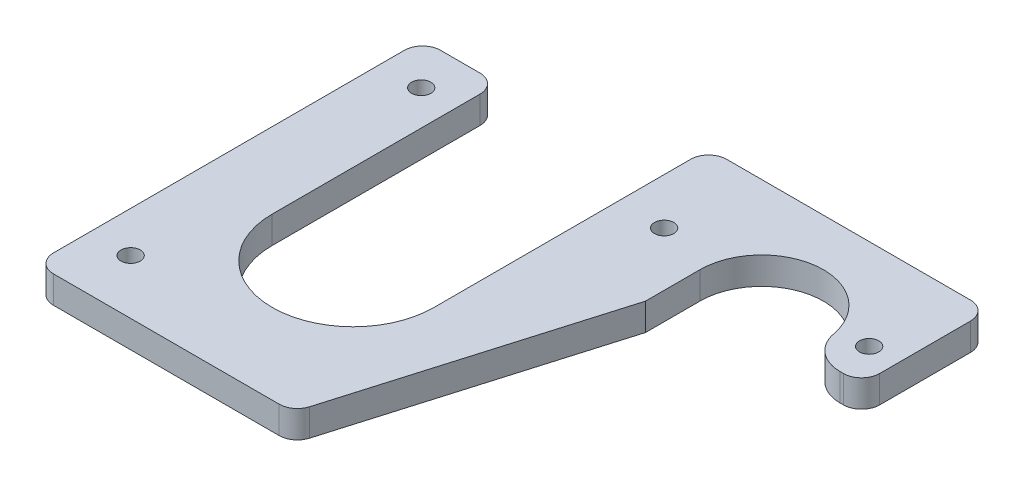
ISO-10303-21;
HEADER;
FILE_DESCRIPTION(('STEP AP214'),'2;1');
FILE_NAME('part.step','',(''),(''),'','','');
FILE_SCHEMA(('AUTOMOTIVE_DESIGN { 1 0 10303 214 1 1 1 1 }'));
ENDSEC;
DATA;
#1=APPLICATION_CONTEXT('core data for automotive mechanical design processes');
#2=APPLICATION_PROTOCOL_DEFINITION('international standard','automotive_design',2000,#1);
#3=PRODUCT_CONTEXT('',#1,'mechanical');
#4=PRODUCT('Part','Part','',(#3));
#5=PRODUCT_RELATED_PRODUCT_CATEGORY('part','',(#4));
#6=PRODUCT_DEFINITION_FORMATION('','',#4);
#7=PRODUCT_DEFINITION_CONTEXT('part definition',#1,'design');
#8=PRODUCT_DEFINITION('design','',#6,#7);
#9=PRODUCT_DEFINITION_SHAPE('','',#8);
#10=(LENGTH_UNIT() NAMED_UNIT(*) SI_UNIT(.MILLI.,.METRE.));
#11=(NAMED_UNIT(*) PLANE_ANGLE_UNIT() SI_UNIT($,.RADIAN.));
#12=(NAMED_UNIT(*) SI_UNIT($,.STERADIAN.) SOLID_ANGLE_UNIT());
#13=UNCERTAINTY_MEASURE_WITH_UNIT(LENGTH_MEASURE(1.E-05),#10,'distance_accuracy_value','');
#14=(GEOMETRIC_REPRESENTATION_CONTEXT(3) GLOBAL_UNCERTAINTY_ASSIGNED_CONTEXT((#13)) GLOBAL_UNIT_ASSIGNED_CONTEXT((#10,
#11,#12)) REPRESENTATION_CONTEXT('',''));
#15=CARTESIAN_POINT('',(0.,0.,0.));
#16=DIRECTION('',(0.,0.,1.));
#17=DIRECTION('',(1.,0.,0.));
#18=AXIS2_PLACEMENT_3D('',#15,#16,#17);
#19=CARTESIAN_POINT('',(82.55,9.525,0.));
#20=DIRECTION('',(-0.959204567325331,0.,-0.282712925106413));
#21=DIRECTION('',(-0.282712925106413,0.,0.959204567325331));
#22=AXIS2_PLACEMENT_3D('',#19,#20,#21);
#23=PLANE('',#22);
#24=DIRECTION('',(0.282712925106413,0.,-0.959204567325331));
#25=VECTOR('',#24,1.);
#26=CARTESIAN_POINT('',(82.55,9.525,0.));
#27=LINE('',#26,#25);
#28=CARTESIAN_POINT('',(91.378775178064,9.525,-29.9547729255743));
#29=VERTEX_POINT('',#28);
#30=CARTESIAN_POINT('',(118.11,9.525,-120.65));
#31=VERTEX_POINT('',#30);
#32=EDGE_CURVE('E232',#29,#31,#27,.T.);
#33=ORIENTED_EDGE('',*,*,#32,.F.);
#34=DIRECTION('',(0.,-1.,0.));
#35=VECTOR('',#34,1.);
#36=CARTESIAN_POINT('',(91.378775178064,9.525,-29.9547729255743));
#37=LINE('',#36,#35);
#38=CARTESIAN_POINT('',(91.378775178064,0.,-29.9547729255743));
#39=VERTEX_POINT('',#38);
#40=EDGE_CURVE('E299',#29,#39,#37,.T.);
#41=ORIENTED_EDGE('',*,*,#40,.T.);
#42=DIRECTION('',(0.282712925106413,0.,-0.959204567325331));
#43=VECTOR('',#42,1.);
#44=CARTESIAN_POINT('',(82.55,0.,0.));
#45=LINE('',#44,#43);
#46=CARTESIAN_POINT('',(118.11,0.,-120.65));
#47=VERTEX_POINT('',#46);
#48=EDGE_CURVE('E231',#39,#47,#45,.T.);
#49=ORIENTED_EDGE('',*,*,#48,.T.);
#50=DIRECTION('',(0.,-1.,0.));
#51=VECTOR('',#50,1.);
#52=CARTESIAN_POINT('',(118.11,9.525,-120.65));
#53=LINE('',#52,#51);
#54=EDGE_CURVE('E265',#31,#47,#53,.T.);
#55=ORIENTED_EDGE('',*,*,#54,.F.);
#56=EDGE_LOOP('',(#33,#41,#49,#55));
#57=FACE_BOUND('',#56,.T.);
#58=ADVANCED_FACE('F32',(#57),#23,.F.);
#59=CARTESIAN_POINT('',(118.11,9.525,-139.7));
#60=DIRECTION('',(-1.,0.,0.));
#61=DIRECTION('',(0.,0.,1.));
#62=AXIS2_PLACEMENT_3D('',#59,#60,#61);
#63=PLANE('',#62);
#64=DIRECTION('',(0.,0.,-1.));
#65=VECTOR('',#64,1.);
#66=CARTESIAN_POINT('',(118.11,0.,-139.7));
#67=LINE('',#66,#65);
#68=CARTESIAN_POINT('',(118.11,0.,-139.7));
#69=VERTEX_POINT('',#68);
#70=EDGE_CURVE('E250',#47,#69,#67,.T.);
#71=ORIENTED_EDGE('',*,*,#70,.T.);
#72=DIRECTION('',(0.,-1.,0.));
#73=VECTOR('',#72,1.);
#74=CARTESIAN_POINT('',(118.11,9.525,-139.7));
#75=LINE('',#74,#73);
#76=CARTESIAN_POINT('',(118.11,9.525,-139.7));
#77=VERTEX_POINT('',#76);
#78=EDGE_CURVE('E248',#77,#69,#75,.T.);
#79=ORIENTED_EDGE('',*,*,#78,.F.);
#80=DIRECTION('',(0.,0.,-1.));
#81=VECTOR('',#80,1.);
#82=CARTESIAN_POINT('',(118.11,9.525,-139.7));
#83=LINE('',#82,#81);
#84=EDGE_CURVE('E234',#31,#77,#83,.T.);
#85=ORIENTED_EDGE('',*,*,#84,.F.);
#86=ORIENTED_EDGE('',*,*,#54,.T.);
#87=EDGE_LOOP('',(#71,#79,#85,#86));
#88=FACE_BOUND('',#87,.T.);
#89=ADVANCED_FACE('F365',(#88),#63,.F.);
#90=CARTESIAN_POINT('',(139.7,9.525,-139.7));
#91=DIRECTION('',(0.,-1.,0.));
#92=DIRECTION('',(0.,0.,-1.));
#93=AXIS2_PLACEMENT_3D('',#90,#91,#92);
#94=CYLINDRICAL_SURFACE('',#93,21.59);
#95=CARTESIAN_POINT('',(139.7,0.,-139.7));
#96=DIRECTION('',(0.,-1.,0.));
#97=DIRECTION('',(0.,0.,1.));
#98=AXIS2_PLACEMENT_3D('',#95,#96,#97);
#99=CIRCLE('',#98,21.59);
#100=CARTESIAN_POINT('',(160.916571621859,0.,-143.698148148148));
#101=VERTEX_POINT('',#100);
#102=EDGE_CURVE('E252',#69,#101,#99,.T.);
#103=ORIENTED_EDGE('',*,*,#102,.T.);
#104=DIRECTION('',(0.,-1.,0.));
#105=VECTOR('',#104,1.);
#106=CARTESIAN_POINT('',(160.916571621859,9.525,-143.698148148148));
#107=LINE('',#106,#105);
#108=CARTESIAN_POINT('',(160.916571621859,9.525,-143.698148148148));
#109=VERTEX_POINT('',#108);
#110=EDGE_CURVE('E323',#101,#109,#107,.F.);
#111=ORIENTED_EDGE('',*,*,#110,.T.);
#112=CARTESIAN_POINT('',(139.7,9.525,-139.7));
#113=DIRECTION('',(0.,-1.,0.));
#114=DIRECTION('',(0.,0.,1.));
#115=AXIS2_PLACEMENT_3D('',#112,#113,#114);
#116=CIRCLE('',#115,21.59);
#117=EDGE_CURVE('E237',#77,#109,#116,.T.);
#118=ORIENTED_EDGE('',*,*,#117,.F.);
#119=ORIENTED_EDGE('',*,*,#78,.T.);
#120=EDGE_LOOP('',(#103,#111,#118,#119));
#121=FACE_BOUND('',#120,.T.);
#122=ADVANCED_FACE('F371',(#121),#94,.F.);
#123=CARTESIAN_POINT('',(180.975,9.525,-139.7));
#124=DIRECTION('',(-1.,0.,0.));
#125=DIRECTION('',(0.,0.,1.));
#126=AXIS2_PLACEMENT_3D('',#123,#124,#125);
#127=PLANE('',#126);
#128=DIRECTION('',(0.,0.,-1.));
#129=VECTOR('',#128,1.);
#130=CARTESIAN_POINT('',(180.975,9.525,-139.7));
#131=LINE('',#130,#129);
#132=CARTESIAN_POINT('',(180.975,9.525,-139.7));
#133=VERTEX_POINT('',#132);
#134=CARTESIAN_POINT('',(180.975,9.525,-171.45));
#135=VERTEX_POINT('',#134);
#136=EDGE_CURVE('E240',#133,#135,#131,.T.);
#137=ORIENTED_EDGE('',*,*,#136,.F.);
#138=DIRECTION('',(0.,1.,0.));
#139=VECTOR('',#138,1.);
#140=CARTESIAN_POINT('',(180.975,9.525,-139.7));
#141=LINE('',#140,#139);
#142=CARTESIAN_POINT('',(180.975,0.,-139.7));
#143=VERTEX_POINT('',#142);
#144=EDGE_CURVE('E318',#133,#143,#141,.F.);
#145=ORIENTED_EDGE('',*,*,#144,.T.);
#146=DIRECTION('',(0.,0.,-1.));
#147=VECTOR('',#146,1.);
#148=CARTESIAN_POINT('',(180.975,0.,-139.7));
#149=LINE('',#148,#147);
#150=CARTESIAN_POINT('',(180.975,0.,-171.45));
#151=VERTEX_POINT('',#150);
#152=EDGE_CURVE('E255',#143,#151,#149,.T.);
#153=ORIENTED_EDGE('',*,*,#152,.T.);
#154=DIRECTION('',(0.,-1.,0.));
#155=VECTOR('',#154,1.);
#156=CARTESIAN_POINT('',(180.975,9.525,-171.45));
#157=LINE('',#156,#155);
#158=EDGE_CURVE('E282',#151,#135,#157,.F.);
#159=ORIENTED_EDGE('',*,*,#158,.T.);
#160=EDGE_LOOP('',(#137,#145,#153,#159));
#161=FACE_BOUND('',#160,.T.);
#162=ADVANCED_FACE('F479',(#161),#127,.F.);
#163=CARTESIAN_POINT('',(80.9625,9.525,-177.8));
#164=DIRECTION('',(0.,0.,1.));
#165=DIRECTION('',(1.,0.,0.));
#166=AXIS2_PLACEMENT_3D('',#163,#164,#165);
#167=PLANE('',#166);
#168=DIRECTION('',(-1.,0.,0.));
#169=VECTOR('',#168,1.);
#170=CARTESIAN_POINT('',(80.9625,0.,-177.8));
#171=LINE('',#170,#169);
#172=CARTESIAN_POINT('',(174.625,0.,-177.8));
#173=VERTEX_POINT('',#172);
#174=CARTESIAN_POINT('',(89.4013784008273,0.,-177.8));
#175=VERTEX_POINT('',#174);
#176=EDGE_CURVE('E257',#173,#175,#171,.T.);
#177=ORIENTED_EDGE('',*,*,#176,.T.);
#178=DIRECTION('',(0.,1.,0.));
#179=VECTOR('',#178,1.);
#180=CARTESIAN_POINT('',(89.4013784008273,9.525,-177.8));
#181=LINE('',#180,#179);
#182=CARTESIAN_POINT('',(89.4013784008273,9.525,-177.8));
#183=VERTEX_POINT('',#182);
#184=EDGE_CURVE('E40',#175,#183,#181,.T.);
#185=ORIENTED_EDGE('',*,*,#184,.T.);
#186=DIRECTION('',(-1.,0.,0.));
#187=VECTOR('',#186,1.);
#188=CARTESIAN_POINT('',(180.975,9.525,-177.8));
#189=LINE('',#188,#187);
#190=CARTESIAN_POINT('',(174.625,9.525,-177.8));
#191=VERTEX_POINT('',#190);
#192=EDGE_CURVE('E242',#191,#183,#189,.T.);
#193=ORIENTED_EDGE('',*,*,#192,.F.);
#194=DIRECTION('',(0.,-1.,0.));
#195=VECTOR('',#194,1.);
#196=CARTESIAN_POINT('',(174.625,9.525,-177.8));
#197=LINE('',#196,#195);
#198=EDGE_CURVE('E304',#191,#173,#197,.T.);
#199=ORIENTED_EDGE('',*,*,#198,.T.);
#200=EDGE_LOOP('',(#177,#185,#193,#199));
#201=FACE_BOUND('',#200,.T.);
#202=ADVANCED_FACE('F345',(#201),#167,.F.);
#203=CARTESIAN_POINT('',(0.,9.525,-160.782));
#204=DIRECTION('',(0.,0.,1.));
#205=DIRECTION('',(1.,0.,0.));
#206=AXIS2_PLACEMENT_3D('',#203,#204,#205);
#207=PLANE('',#206);
#208=DIRECTION('',(-1.,0.,0.));
#209=VECTOR('',#208,1.);
#210=CARTESIAN_POINT('',(0.,9.525,-160.782));
#211=LINE('',#210,#209);
#212=CARTESIAN_POINT('',(20.1361215991727,9.525,-160.782));
#213=VERTEX_POINT('',#212);
#214=CARTESIAN_POINT('',(6.35,9.525,-160.782));
#215=VERTEX_POINT('',#214);
#216=EDGE_CURVE('E244',#213,#215,#211,.T.);
#217=ORIENTED_EDGE('',*,*,#216,.F.);
#218=DIRECTION('',(0.,-1.,0.));
#219=VECTOR('',#218,1.);
#220=CARTESIAN_POINT('',(20.1361215991727,9.525,-160.782));
#221=LINE('',#220,#219);
#222=CARTESIAN_POINT('',(20.1361215991727,0.,-160.782));
#223=VERTEX_POINT('',#222);
#224=EDGE_CURVE('E332',#213,#223,#221,.T.);
#225=ORIENTED_EDGE('',*,*,#224,.T.);
#226=DIRECTION('',(-1.,0.,0.));
#227=VECTOR('',#226,1.);
#228=CARTESIAN_POINT('',(0.,0.,-160.782));
#229=LINE('',#228,#227);
#230=CARTESIAN_POINT('',(6.35,0.,-160.782));
#231=VERTEX_POINT('',#230);
#232=EDGE_CURVE('E260',#223,#231,#229,.T.);
#233=ORIENTED_EDGE('',*,*,#232,.T.);
#234=DIRECTION('',(0.,-1.,0.));
#235=VECTOR('',#234,1.);
#236=CARTESIAN_POINT('',(6.35,9.525,-160.782));
#237=LINE('',#236,#235);
#238=EDGE_CURVE('E310',#231,#215,#237,.F.);
#239=ORIENTED_EDGE('',*,*,#238,.T.);
#240=EDGE_LOOP('',(#217,#225,#233,#239));
#241=FACE_BOUND('',#240,.T.);
#242=ADVANCED_FACE('F436',(#241),#207,.F.);
#243=CARTESIAN_POINT('',(0.,9.525,-160.782));
#244=DIRECTION('',(1.,0.,0.));
#245=DIRECTION('',(0.,0.,-1.));
#246=AXIS2_PLACEMENT_3D('',#243,#244,#245);
#247=PLANE('',#246);
#248=DIRECTION('',(0.,0.,1.));
#249=VECTOR('',#248,1.);
#250=CARTESIAN_POINT('',(0.,9.525,-160.782));
#251=LINE('',#250,#249);
#252=CARTESIAN_POINT('',(0.,9.525,-154.432));
#253=VERTEX_POINT('',#252);
#254=CARTESIAN_POINT('',(0.,9.525,-31.75));
#255=VERTEX_POINT('',#254);
#256=EDGE_CURVE('E246',#253,#255,#251,.T.);
#257=ORIENTED_EDGE('',*,*,#256,.F.);
#258=DIRECTION('',(0.,-1.,0.));
#259=VECTOR('',#258,1.);
#260=CARTESIAN_POINT('',(0.,9.525,-154.432));
#261=LINE('',#260,#259);
#262=CARTESIAN_POINT('',(0.,0.,-154.432));
#263=VERTEX_POINT('',#262);
#264=EDGE_CURVE('E307',#253,#263,#261,.T.);
#265=ORIENTED_EDGE('',*,*,#264,.T.);
#266=DIRECTION('',(0.,0.,1.));
#267=VECTOR('',#266,1.);
#268=CARTESIAN_POINT('',(0.,0.,-160.782));
#269=LINE('',#268,#267);
#270=CARTESIAN_POINT('',(0.,0.,-31.75));
#271=VERTEX_POINT('',#270);
#272=EDGE_CURVE('E235',#263,#271,#269,.T.);
#273=ORIENTED_EDGE('',*,*,#272,.T.);
#274=DIRECTION('',(0.,1.,0.));
#275=VECTOR('',#274,1.);
#276=CARTESIAN_POINT('',(0.,9.525,-31.75));
#277=LINE('',#276,#275);
#278=EDGE_CURVE('E270',#271,#255,#277,.T.);
#279=ORIENTED_EDGE('',*,*,#278,.T.);
#280=EDGE_LOOP('',(#257,#265,#273,#279));
#281=FACE_BOUND('',#280,.T.);
#282=ADVANCED_FACE('F431',(#281),#247,.F.);
#283=CARTESIAN_POINT('',(139.7,9.525,-139.7));
#284=DIRECTION('',(0.,1.,0.));
#285=DIRECTION('',(0.,0.,1.));
#286=AXIS2_PLACEMENT_3D('',#283,#284,#285);
#287=PLANE('',#286);
#288=DIRECTION('',(0.,0.,1.));
#289=VECTOR('',#288,1.);
#290=CARTESIAN_POINT('',(26.4861215991727,9.525,-81.75625));
#291=LINE('',#290,#289);
#292=CARTESIAN_POINT('',(26.4861215991727,9.525,-154.432));
#293=VERTEX_POINT('',#292);
#294=CARTESIAN_POINT('',(26.4861215991727,9.525,-81.75625));
#295=VERTEX_POINT('',#294);
#296=EDGE_CURVE('E191',#293,#295,#291,.T.);
#297=ORIENTED_EDGE('',*,*,#296,.F.);
#298=CARTESIAN_POINT('',(20.1361215991727,9.525,-154.432));
#299=DIRECTION('',(0.,1.,0.));
#300=DIRECTION('',(0.,0.,1.));
#301=AXIS2_PLACEMENT_3D('',#298,#299,#300);
#302=CIRCLE('',#301,6.35);
#303=EDGE_CURVE('E342',#293,#213,#302,.T.);
#304=ORIENTED_EDGE('',*,*,#303,.T.);
#305=ORIENTED_EDGE('',*,*,#216,.T.);
#306=CARTESIAN_POINT('',(6.35,9.525,-154.432));
#307=DIRECTION('',(0.,1.,0.));
#308=DIRECTION('',(0.,0.,1.));
#309=AXIS2_PLACEMENT_3D('',#306,#307,#308);
#310=CIRCLE('',#309,6.35);
#311=EDGE_CURVE('E293',#215,#253,#310,.T.);
#312=ORIENTED_EDGE('',*,*,#311,.T.);
#313=ORIENTED_EDGE('',*,*,#256,.T.);
#314=CARTESIAN_POINT('',(6.35,9.525,-31.75));
#315=DIRECTION('',(0.,1.,0.));
#316=DIRECTION('',(0.,0.,1.));
#317=AXIS2_PLACEMENT_3D('',#314,#315,#316);
#318=CIRCLE('',#317,6.35);
#319=CARTESIAN_POINT('',(6.35,9.525,-25.4));
#320=VERTEX_POINT('',#319);
#321=EDGE_CURVE('E273',#255,#320,#318,.T.);
#322=ORIENTED_EDGE('',*,*,#321,.T.);
#323=DIRECTION('',(-1.,0.,0.));
#324=VECTOR('',#323,1.);
#325=CARTESIAN_POINT('',(0.,9.525,-25.4));
#326=LINE('',#325,#324);
#327=CARTESIAN_POINT('',(85.2878261755481,9.525,-25.4));
#328=VERTEX_POINT('',#327);
#329=EDGE_CURVE('E229',#328,#320,#326,.T.);
#330=ORIENTED_EDGE('',*,*,#329,.F.);
#331=CARTESIAN_POINT('',(85.2878261755481,9.525,-31.75));
#332=DIRECTION('',(0.,1.,0.));
#333=DIRECTION('',(0.,0.,1.));
#334=AXIS2_PLACEMENT_3D('',#331,#332,#333);
#335=CIRCLE('',#334,6.35);
#336=EDGE_CURVE('E297',#328,#29,#335,.T.);
#337=ORIENTED_EDGE('',*,*,#336,.T.);
#338=ORIENTED_EDGE('',*,*,#32,.T.);
#339=ORIENTED_EDGE('',*,*,#84,.T.);
#340=ORIENTED_EDGE('',*,*,#117,.T.);
#341=CARTESIAN_POINT('',(173.396907870011,9.525,-146.05));
#342=DIRECTION('',(0.,1.,0.));
#343=DIRECTION('',(0.,0.,1.));
#344=AXIS2_PLACEMENT_3D('',#341,#342,#343);
#345=CIRCLE('',#344,12.7);
#346=CARTESIAN_POINT('',(173.396907870011,9.525,-133.35));
#347=VERTEX_POINT('',#346);
#348=EDGE_CURVE('E326',#109,#347,#345,.T.);
#349=ORIENTED_EDGE('',*,*,#348,.T.);
#350=DIRECTION('',(-1.,0.,0.));
#351=VECTOR('',#350,1.);
#352=CARTESIAN_POINT('',(161.29,9.525,-133.35));
#353=LINE('',#352,#351);
#354=CARTESIAN_POINT('',(174.625,9.525,-133.35));
#355=VERTEX_POINT('',#354);
#356=EDGE_CURVE('E198',#355,#347,#353,.T.);
#357=ORIENTED_EDGE('',*,*,#356,.F.);
#358=CARTESIAN_POINT('',(174.625,9.525,-139.7));
#359=DIRECTION('',(0.,1.,0.));
#360=DIRECTION('',(0.,0.,1.));
#361=AXIS2_PLACEMENT_3D('',#358,#359,#360);
#362=CIRCLE('',#361,6.35);
#363=EDGE_CURVE('E316',#355,#133,#362,.T.);
#364=ORIENTED_EDGE('',*,*,#363,.T.);
#365=ORIENTED_EDGE('',*,*,#136,.T.);
#366=CARTESIAN_POINT('',(174.625,9.525,-171.45));
#367=DIRECTION('',(0.,1.,0.));
#368=DIRECTION('',(0.,0.,1.));
#369=AXIS2_PLACEMENT_3D('',#366,#367,#368);
#370=CIRCLE('',#369,6.35);
#371=EDGE_CURVE('E295',#135,#191,#370,.T.);
#372=ORIENTED_EDGE('',*,*,#371,.T.);
#373=ORIENTED_EDGE('',*,*,#192,.T.);
#374=CARTESIAN_POINT('',(89.4013784008273,9.525,-171.45));
#375=DIRECTION('',(0.,1.,0.));
#376=DIRECTION('',(0.,0.,1.));
#377=AXIS2_PLACEMENT_3D('',#374,#375,#376);
#378=CIRCLE('',#377,6.35);
#379=CARTESIAN_POINT('',(83.0513784008273,9.525,-171.45));
#380=VERTEX_POINT('',#379);
#381=EDGE_CURVE('E47',#183,#380,#378,.T.);
#382=ORIENTED_EDGE('',*,*,#381,.T.);
#383=DIRECTION('',(0.,0.,-1.));
#384=VECTOR('',#383,1.);
#385=CARTESIAN_POINT('',(83.0513784008273,9.525,-177.8));
#386=LINE('',#385,#384);
#387=CARTESIAN_POINT('',(83.0513784008273,9.525,-81.75625));
#388=VERTEX_POINT('',#387);
#389=EDGE_CURVE('E193',#388,#380,#386,.T.);
#390=ORIENTED_EDGE('',*,*,#389,.F.);
#391=CARTESIAN_POINT('',(54.76875,9.525,-81.75625));
#392=DIRECTION('',(0.,1.,0.));
#393=DIRECTION('',(0.,0.,1.));
#394=AXIS2_PLACEMENT_3D('',#391,#392,#393);
#395=CIRCLE('',#394,28.2826284008273);
#396=EDGE_CURVE('E176',#295,#388,#395,.T.);
#397=ORIENTED_EDGE('',*,*,#396,.F.);
#398=EDGE_LOOP('',(#297,#304,#305,#312,#313,#322,#330,#337,#338,#339,#340,#349,#357,#364,#365,
#372,#373,#382,#390,#397));
#399=FACE_BOUND('',#398,.T.);
#400=CARTESIAN_POINT('',(14.2875,9.525,-146.05));
#401=DIRECTION('',(0.,1.,0.));
#402=DIRECTION('',(0.,0.,1.));
#403=AXIS2_PLACEMENT_3D('',#400,#401,#402);
#404=CIRCLE('',#403,3.37819999999999);
#405=CARTESIAN_POINT('',(14.2875,9.525,-142.6718));
#406=VERTEX_POINT('',#405);
#407=EDGE_CURVE('E203',#406,#406,#404,.T.);
#408=ORIENTED_EDGE('',*,*,#407,.F.);
#409=EDGE_LOOP('',(#408));
#410=FACE_BOUND('',#409,.T.);
#411=CARTESIAN_POINT('',(14.2875,9.525,-44.45));
#412=DIRECTION('',(0.,1.,0.));
#413=DIRECTION('',(0.,0.,1.));
#414=AXIS2_PLACEMENT_3D('',#411,#412,#413);
#415=CIRCLE('',#414,3.37819999999999);
#416=CARTESIAN_POINT('',(14.2875,9.525,-41.0718));
#417=VERTEX_POINT('',#416);
#418=EDGE_CURVE('E211',#417,#417,#415,.T.);
#419=ORIENTED_EDGE('',*,*,#418,.F.);
#420=EDGE_LOOP('',(#419));
#421=FACE_BOUND('',#420,.T.);
#422=CARTESIAN_POINT('',(99.2378,9.525,-146.05));
#423=DIRECTION('',(0.,1.,0.));
#424=DIRECTION('',(0.,0.,1.));
#425=AXIS2_PLACEMENT_3D('',#422,#423,#424);
#426=CIRCLE('',#425,3.37819999999998);
#427=CARTESIAN_POINT('',(99.2378,9.525,-142.6718));
#428=VERTEX_POINT('',#427);
#429=EDGE_CURVE('E217',#428,#428,#426,.T.);
#430=ORIENTED_EDGE('',*,*,#429,.F.);
#431=EDGE_LOOP('',(#430));
#432=FACE_BOUND('',#431,.T.);
#433=CARTESIAN_POINT('',(170.92295,9.525,-146.05));
#434=DIRECTION('',(0.,1.,0.));
#435=DIRECTION('',(0.,0.,1.));
#436=AXIS2_PLACEMENT_3D('',#433,#434,#435);
#437=CIRCLE('',#436,3.3782);
#438=CARTESIAN_POINT('',(170.92295,9.525,-142.6718));
#439=VERTEX_POINT('',#438);
#440=EDGE_CURVE('E223',#439,#439,#437,.T.);
#441=ORIENTED_EDGE('',*,*,#440,.F.);
#442=EDGE_LOOP('',(#441));
#443=FACE_BOUND('',#442,.T.);
#444=ADVANCED_FACE('F349',(#399,#410,#421,#432,#443),#287,.T.);
#445=CARTESIAN_POINT('',(139.7,0.,-139.7));
#446=DIRECTION('',(0.,1.,0.));
#447=DIRECTION('',(0.,0.,1.));
#448=AXIS2_PLACEMENT_3D('',#445,#446,#447);
#449=PLANE('',#448);
#450=CARTESIAN_POINT('',(14.2875,0.,-146.05));
#451=DIRECTION('',(0.,1.,0.));
#452=DIRECTION('',(0.,0.,1.));
#453=AXIS2_PLACEMENT_3D('',#450,#451,#452);
#454=CIRCLE('',#453,3.3782);
#455=CARTESIAN_POINT('',(14.2875,0.,-142.6718));
#456=VERTEX_POINT('',#455);
#457=EDGE_CURVE('E208',#456,#456,#454,.T.);
#458=ORIENTED_EDGE('',*,*,#457,.T.);
#459=EDGE_LOOP('',(#458));
#460=FACE_BOUND('',#459,.T.);
#461=CARTESIAN_POINT('',(14.2875,0.,-44.45));
#462=DIRECTION('',(0.,1.,0.));
#463=DIRECTION('',(0.,0.,1.));
#464=AXIS2_PLACEMENT_3D('',#461,#462,#463);
#465=CIRCLE('',#464,3.3782);
#466=CARTESIAN_POINT('',(14.2875,0.,-41.0718));
#467=VERTEX_POINT('',#466);
#468=EDGE_CURVE('E214',#467,#467,#465,.T.);
#469=ORIENTED_EDGE('',*,*,#468,.T.);
#470=EDGE_LOOP('',(#469));
#471=FACE_BOUND('',#470,.T.);
#472=CARTESIAN_POINT('',(99.2378,0.,-146.05));
#473=DIRECTION('',(0.,1.,0.));
#474=DIRECTION('',(0.,0.,1.));
#475=AXIS2_PLACEMENT_3D('',#472,#473,#474);
#476=CIRCLE('',#475,3.3782);
#477=CARTESIAN_POINT('',(99.2378,0.,-142.6718));
#478=VERTEX_POINT('',#477);
#479=EDGE_CURVE('E220',#478,#478,#476,.T.);
#480=ORIENTED_EDGE('',*,*,#479,.T.);
#481=EDGE_LOOP('',(#480));
#482=FACE_BOUND('',#481,.T.);
#483=CARTESIAN_POINT('',(170.92295,0.,-146.05));
#484=DIRECTION('',(0.,1.,0.));
#485=DIRECTION('',(0.,0.,1.));
#486=AXIS2_PLACEMENT_3D('',#483,#484,#485);
#487=CIRCLE('',#486,3.3782);
#488=CARTESIAN_POINT('',(170.92295,0.,-142.6718));
#489=VERTEX_POINT('',#488);
#490=EDGE_CURVE('E226',#489,#489,#487,.T.);
#491=ORIENTED_EDGE('',*,*,#490,.T.);
#492=EDGE_LOOP('',(#491));
#493=FACE_BOUND('',#492,.T.);
#494=ORIENTED_EDGE('',*,*,#232,.F.);
#495=CARTESIAN_POINT('',(20.1361215991727,0.,-154.432));
#496=DIRECTION('',(0.,1.,0.));
#497=DIRECTION('',(0.,0.,1.));
#498=AXIS2_PLACEMENT_3D('',#495,#496,#497);
#499=CIRCLE('',#498,6.35);
#500=CARTESIAN_POINT('',(26.4861215991727,0.,-154.432));
#501=VERTEX_POINT('',#500);
#502=EDGE_CURVE('E337',#223,#501,#499,.F.);
#503=ORIENTED_EDGE('',*,*,#502,.T.);
#504=DIRECTION('',(0.,0.,1.));
#505=VECTOR('',#504,1.);
#506=CARTESIAN_POINT('',(26.4861215991727,0.,-139.7));
#507=LINE('',#506,#505);
#508=CARTESIAN_POINT('',(26.4861215991727,0.,-81.75625));
#509=VERTEX_POINT('',#508);
#510=EDGE_CURVE('E189',#501,#509,#507,.T.);
#511=ORIENTED_EDGE('',*,*,#510,.T.);
#512=CARTESIAN_POINT('',(54.76875,0.,-81.75625));
#513=DIRECTION('',(0.,1.,0.));
#514=DIRECTION('',(0.,0.,1.));
#515=AXIS2_PLACEMENT_3D('',#512,#513,#514);
#516=CIRCLE('',#515,28.2826284008273);
#517=CARTESIAN_POINT('',(83.0513784008273,0.,-81.75625));
#518=VERTEX_POINT('',#517);
#519=EDGE_CURVE('E174',#509,#518,#516,.T.);
#520=ORIENTED_EDGE('',*,*,#519,.T.);
#521=DIRECTION('',(0.,0.,-1.));
#522=VECTOR('',#521,1.);
#523=CARTESIAN_POINT('',(83.0513784008273,0.,-177.8));
#524=LINE('',#523,#522);
#525=CARTESIAN_POINT('',(83.0513784008273,0.,-171.45));
#526=VERTEX_POINT('',#525);
#527=EDGE_CURVE('E179',#518,#526,#524,.T.);
#528=ORIENTED_EDGE('',*,*,#527,.T.);
#529=CARTESIAN_POINT('',(89.4013784008273,0.,-171.45));
#530=DIRECTION('',(0.,1.,0.));
#531=DIRECTION('',(0.,0.,1.));
#532=AXIS2_PLACEMENT_3D('',#529,#530,#531);
#533=CIRCLE('',#532,6.35);
#534=EDGE_CURVE('E335',#526,#175,#533,.F.);
#535=ORIENTED_EDGE('',*,*,#534,.T.);
#536=ORIENTED_EDGE('',*,*,#176,.F.);
#537=CARTESIAN_POINT('',(174.625,0.,-171.45));
#538=DIRECTION('',(0.,1.,0.));
#539=DIRECTION('',(0.,0.,1.));
#540=AXIS2_PLACEMENT_3D('',#537,#538,#539);
#541=CIRCLE('',#540,6.35);
#542=EDGE_CURVE('E288',#173,#151,#541,.F.);
#543=ORIENTED_EDGE('',*,*,#542,.T.);
#544=ORIENTED_EDGE('',*,*,#152,.F.);
#545=CARTESIAN_POINT('',(174.625,0.,-139.7));
#546=DIRECTION('',(0.,1.,0.));
#547=DIRECTION('',(0.,0.,1.));
#548=AXIS2_PLACEMENT_3D('',#545,#546,#547);
#549=CIRCLE('',#548,6.35);
#550=CARTESIAN_POINT('',(174.625,0.,-133.35));
#551=VERTEX_POINT('',#550);
#552=EDGE_CURVE('E320',#143,#551,#549,.F.);
#553=ORIENTED_EDGE('',*,*,#552,.T.);
#554=DIRECTION('',(-1.,0.,0.));
#555=VECTOR('',#554,1.);
#556=CARTESIAN_POINT('',(161.29,0.,-133.35));
#557=LINE('',#556,#555);
#558=CARTESIAN_POINT('',(173.396907870011,0.,-133.35));
#559=VERTEX_POINT('',#558);
#560=EDGE_CURVE('E200',#551,#559,#557,.T.);
#561=ORIENTED_EDGE('',*,*,#560,.T.);
#562=CARTESIAN_POINT('',(173.396907870011,0.,-146.05));
#563=DIRECTION('',(0.,1.,0.));
#564=DIRECTION('',(0.,0.,1.));
#565=AXIS2_PLACEMENT_3D('',#562,#563,#564);
#566=CIRCLE('',#565,12.7);
#567=EDGE_CURVE('E330',#559,#101,#566,.F.);
#568=ORIENTED_EDGE('',*,*,#567,.T.);
#569=ORIENTED_EDGE('',*,*,#102,.F.);
#570=ORIENTED_EDGE('',*,*,#70,.F.);
#571=ORIENTED_EDGE('',*,*,#48,.F.);
#572=CARTESIAN_POINT('',(85.2878261755481,0.,-31.75));
#573=DIRECTION('',(0.,1.,0.));
#574=DIRECTION('',(0.,0.,1.));
#575=AXIS2_PLACEMENT_3D('',#572,#573,#574);
#576=CIRCLE('',#575,6.35);
#577=CARTESIAN_POINT('',(85.2878261755481,0.,-25.4));
#578=VERTEX_POINT('',#577);
#579=EDGE_CURVE('E291',#39,#578,#576,.F.);
#580=ORIENTED_EDGE('',*,*,#579,.T.);
#581=DIRECTION('',(-1.,0.,0.));
#582=VECTOR('',#581,1.);
#583=CARTESIAN_POINT('',(139.7,0.,-25.4));
#584=LINE('',#583,#582);
#585=CARTESIAN_POINT('',(6.34999999999999,0.,-25.4));
#586=VERTEX_POINT('',#585);
#587=EDGE_CURVE('E268',#578,#586,#584,.T.);
#588=ORIENTED_EDGE('',*,*,#587,.T.);
#589=CARTESIAN_POINT('',(6.35,0.,-31.75));
#590=DIRECTION('',(0.,1.,0.));
#591=DIRECTION('',(0.,0.,1.));
#592=AXIS2_PLACEMENT_3D('',#589,#590,#591);
#593=CIRCLE('',#592,6.35);
#594=EDGE_CURVE('E279',#586,#271,#593,.F.);
#595=ORIENTED_EDGE('',*,*,#594,.T.);
#596=ORIENTED_EDGE('',*,*,#272,.F.);
#597=CARTESIAN_POINT('',(6.35,0.,-154.432));
#598=DIRECTION('',(0.,1.,0.));
#599=DIRECTION('',(0.,0.,1.));
#600=AXIS2_PLACEMENT_3D('',#597,#598,#599);
#601=CIRCLE('',#600,6.35);
#602=EDGE_CURVE('E285',#263,#231,#601,.F.);
#603=ORIENTED_EDGE('',*,*,#602,.T.);
#604=EDGE_LOOP('',(#494,#503,#511,#520,#528,#535,#536,#543,#544,#553,#561,#568,#569,#570,#571,
#580,#588,#595,#596,#603));
#605=FACE_BOUND('',#604,.T.);
#606=ADVANCED_FACE('F187',(#460,#471,#482,#493,#605),#449,.F.);
#607=CARTESIAN_POINT('',(0.,0.,-25.4));
#608=DIRECTION('',(0.,0.,-1.));
#609=DIRECTION('',(-1.,0.,0.));
#610=AXIS2_PLACEMENT_3D('',#607,#608,#609);
#611=PLANE('',#610);
#612=ORIENTED_EDGE('',*,*,#587,.F.);
#613=DIRECTION('',(0.,-1.,0.));
#614=VECTOR('',#613,1.);
#615=CARTESIAN_POINT('',(85.2878261755481,0.,-25.4));
#616=LINE('',#615,#614);
#617=EDGE_CURVE('E302',#578,#328,#616,.F.);
#618=ORIENTED_EDGE('',*,*,#617,.T.);
#619=ORIENTED_EDGE('',*,*,#329,.T.);
#620=DIRECTION('',(0.,1.,0.));
#621=VECTOR('',#620,1.);
#622=CARTESIAN_POINT('',(6.35,0.,-25.4));
#623=LINE('',#622,#621);
#624=EDGE_CURVE('E276',#320,#586,#623,.F.);
#625=ORIENTED_EDGE('',*,*,#624,.T.);
#626=EDGE_LOOP('',(#612,#618,#619,#625));
#627=FACE_BOUND('',#626,.T.);
#628=ADVANCED_FACE('F381',(#627),#611,.F.);
#629=CARTESIAN_POINT('',(6.35,9.525,-31.75));
#630=DIRECTION('',(0.,1.,0.));
#631=DIRECTION('',(0.,0.,1.));
#632=AXIS2_PLACEMENT_3D('',#629,#630,#631);
#633=CYLINDRICAL_SURFACE('',#632,6.35);
#634=ORIENTED_EDGE('',*,*,#594,.F.);
#635=ORIENTED_EDGE('',*,*,#624,.F.);
#636=ORIENTED_EDGE('',*,*,#321,.F.);
#637=ORIENTED_EDGE('',*,*,#278,.F.);
#638=EDGE_LOOP('',(#634,#635,#636,#637));
#639=FACE_BOUND('',#638,.T.);
#640=ADVANCED_FACE('F377',(#639),#633,.T.);
#641=CARTESIAN_POINT('',(85.2878261755481,9.525,-31.75));
#642=DIRECTION('',(0.,-1.,0.));
#643=DIRECTION('',(0.,0.,-1.));
#644=AXIS2_PLACEMENT_3D('',#641,#642,#643);
#645=CYLINDRICAL_SURFACE('',#644,6.35);
#646=ORIENTED_EDGE('',*,*,#336,.F.);
#647=ORIENTED_EDGE('',*,*,#617,.F.);
#648=ORIENTED_EDGE('',*,*,#579,.F.);
#649=ORIENTED_EDGE('',*,*,#40,.F.);
#650=EDGE_LOOP('',(#646,#647,#648,#649));
#651=FACE_BOUND('',#650,.T.);
#652=ADVANCED_FACE('F380',(#651),#645,.T.);
#653=CARTESIAN_POINT('',(174.625,9.525,-171.45));
#654=DIRECTION('',(0.,-1.,0.));
#655=DIRECTION('',(0.,0.,-1.));
#656=AXIS2_PLACEMENT_3D('',#653,#654,#655);
#657=CYLINDRICAL_SURFACE('',#656,6.35);
#658=ORIENTED_EDGE('',*,*,#371,.F.);
#659=ORIENTED_EDGE('',*,*,#158,.F.);
#660=ORIENTED_EDGE('',*,*,#542,.F.);
#661=ORIENTED_EDGE('',*,*,#198,.F.);
#662=EDGE_LOOP('',(#658,#659,#660,#661));
#663=FACE_BOUND('',#662,.T.);
#664=ADVANCED_FACE('F355',(#663),#657,.T.);
#665=CARTESIAN_POINT('',(6.35,9.525,-154.432));
#666=DIRECTION('',(0.,-1.,0.));
#667=DIRECTION('',(0.,0.,-1.));
#668=AXIS2_PLACEMENT_3D('',#665,#666,#667);
#669=CYLINDRICAL_SURFACE('',#668,6.35);
#670=ORIENTED_EDGE('',*,*,#311,.F.);
#671=ORIENTED_EDGE('',*,*,#238,.F.);
#672=ORIENTED_EDGE('',*,*,#602,.F.);
#673=ORIENTED_EDGE('',*,*,#264,.F.);
#674=EDGE_LOOP('',(#670,#671,#672,#673));
#675=FACE_BOUND('',#674,.T.);
#676=ADVANCED_FACE('F388',(#675),#669,.T.);
#677=CARTESIAN_POINT('',(170.92295,9.525,-146.05));
#678=DIRECTION('',(0.,1.,0.));
#679=DIRECTION('',(0.,0.,1.));
#680=AXIS2_PLACEMENT_3D('',#677,#678,#679);
#681=CYLINDRICAL_SURFACE('',#680,3.3782);
#682=ORIENTED_EDGE('',*,*,#490,.F.);
#683=EDGE_LOOP('',(#682));
#684=FACE_BOUND('',#683,.T.);
#685=ORIENTED_EDGE('',*,*,#440,.T.);
#686=EDGE_LOOP('',(#685));
#687=FACE_BOUND('',#686,.T.);
#688=ADVANCED_FACE('F391',(#684,#687),#681,.F.);
#689=CARTESIAN_POINT('',(99.2378,9.525,-146.05));
#690=DIRECTION('',(0.,1.,0.));
#691=DIRECTION('',(0.,0.,1.));
#692=AXIS2_PLACEMENT_3D('',#689,#690,#691);
#693=CYLINDRICAL_SURFACE('',#692,3.37819999999999);
#694=ORIENTED_EDGE('',*,*,#479,.F.);
#695=EDGE_LOOP('',(#694));
#696=FACE_BOUND('',#695,.T.);
#697=ORIENTED_EDGE('',*,*,#429,.T.);
#698=EDGE_LOOP('',(#697));
#699=FACE_BOUND('',#698,.T.);
#700=ADVANCED_FACE('F458',(#696,#699),#693,.F.);
#701=CARTESIAN_POINT('',(14.2875,9.525,-44.45));
#702=DIRECTION('',(0.,1.,0.));
#703=DIRECTION('',(0.,0.,1.));
#704=AXIS2_PLACEMENT_3D('',#701,#702,#703);
#705=CYLINDRICAL_SURFACE('',#704,3.37819999999999);
#706=ORIENTED_EDGE('',*,*,#468,.F.);
#707=EDGE_LOOP('',(#706));
#708=FACE_BOUND('',#707,.T.);
#709=ORIENTED_EDGE('',*,*,#418,.T.);
#710=EDGE_LOOP('',(#709));
#711=FACE_BOUND('',#710,.T.);
#712=ADVANCED_FACE('F454',(#708,#711),#705,.F.);
#713=CARTESIAN_POINT('',(14.2875,9.525,-146.05));
#714=DIRECTION('',(0.,1.,0.));
#715=DIRECTION('',(0.,0.,1.));
#716=AXIS2_PLACEMENT_3D('',#713,#714,#715);
#717=CYLINDRICAL_SURFACE('',#716,3.37819999999999);
#718=ORIENTED_EDGE('',*,*,#457,.F.);
#719=EDGE_LOOP('',(#718));
#720=FACE_BOUND('',#719,.T.);
#721=ORIENTED_EDGE('',*,*,#407,.T.);
#722=EDGE_LOOP('',(#721));
#723=FACE_BOUND('',#722,.T.);
#724=ADVANCED_FACE('F450',(#720,#723),#717,.F.);
#725=CARTESIAN_POINT('',(161.29,0.,-133.35));
#726=DIRECTION('',(0.,0.,-1.));
#727=DIRECTION('',(-1.,0.,0.));
#728=AXIS2_PLACEMENT_3D('',#725,#726,#727);
#729=PLANE('',#728);
#730=ORIENTED_EDGE('',*,*,#356,.T.);
#731=DIRECTION('',(0.,-1.,0.));
#732=VECTOR('',#731,1.);
#733=CARTESIAN_POINT('',(173.396907870011,0.,-133.35));
#734=LINE('',#733,#732);
#735=EDGE_CURVE('E328',#347,#559,#734,.T.);
#736=ORIENTED_EDGE('',*,*,#735,.T.);
#737=ORIENTED_EDGE('',*,*,#560,.F.);
#738=DIRECTION('',(0.,1.,0.));
#739=VECTOR('',#738,1.);
#740=CARTESIAN_POINT('',(174.625,0.,-133.35));
#741=LINE('',#740,#739);
#742=EDGE_CURVE('E313',#551,#355,#741,.T.);
#743=ORIENTED_EDGE('',*,*,#742,.T.);
#744=EDGE_LOOP('',(#730,#736,#737,#743));
#745=FACE_BOUND('',#744,.T.);
#746=ADVANCED_FACE('F397',(#745),#729,.F.);
#747=CARTESIAN_POINT('',(174.625,0.,-139.7));
#748=DIRECTION('',(0.,1.,0.));
#749=DIRECTION('',(0.,0.,1.));
#750=AXIS2_PLACEMENT_3D('',#747,#748,#749);
#751=CYLINDRICAL_SURFACE('',#750,6.35);
#752=ORIENTED_EDGE('',*,*,#552,.F.);
#753=ORIENTED_EDGE('',*,*,#144,.F.);
#754=ORIENTED_EDGE('',*,*,#363,.F.);
#755=ORIENTED_EDGE('',*,*,#742,.F.);
#756=EDGE_LOOP('',(#752,#753,#754,#755));
#757=FACE_BOUND('',#756,.T.);
#758=ADVANCED_FACE('F393',(#757),#751,.T.);
#759=CARTESIAN_POINT('',(26.4861215991727,0.,-81.75625));
#760=DIRECTION('',(-1.,0.,0.));
#761=DIRECTION('',(0.,0.,1.));
#762=AXIS2_PLACEMENT_3D('',#759,#760,#761);
#763=PLANE('',#762);
#764=ORIENTED_EDGE('',*,*,#510,.F.);
#765=DIRECTION('',(0.,-1.,0.));
#766=VECTOR('',#765,1.);
#767=CARTESIAN_POINT('',(26.4861215991727,0.,-154.432));
#768=LINE('',#767,#766);
#769=EDGE_CURVE('E339',#501,#293,#768,.F.);
#770=ORIENTED_EDGE('',*,*,#769,.T.);
#771=ORIENTED_EDGE('',*,*,#296,.T.);
#772=DIRECTION('',(0.,1.,0.));
#773=VECTOR('',#772,1.);
#774=CARTESIAN_POINT('',(26.4861215991727,0.,-81.75625));
#775=LINE('',#774,#773);
#776=EDGE_CURVE('E178',#509,#295,#775,.T.);
#777=ORIENTED_EDGE('',*,*,#776,.F.);
#778=EDGE_LOOP('',(#764,#770,#771,#777));
#779=FACE_BOUND('',#778,.T.);
#780=ADVANCED_FACE('F396',(#779),#763,.F.);
#781=CARTESIAN_POINT('',(54.76875,0.,-81.75625));
#782=DIRECTION('',(0.,1.,0.));
#783=DIRECTION('',(0.,0.,1.));
#784=AXIS2_PLACEMENT_3D('',#781,#782,#783);
#785=CYLINDRICAL_SURFACE('',#784,28.2826284008273);
#786=ORIENTED_EDGE('',*,*,#396,.T.);
#787=DIRECTION('',(0.,1.,0.));
#788=VECTOR('',#787,1.);
#789=CARTESIAN_POINT('',(83.0513784008273,0.,-81.75625));
#790=LINE('',#789,#788);
#791=EDGE_CURVE('E169',#518,#388,#790,.T.);
#792=ORIENTED_EDGE('',*,*,#791,.F.);
#793=ORIENTED_EDGE('',*,*,#519,.F.);
#794=ORIENTED_EDGE('',*,*,#776,.T.);
#795=EDGE_LOOP('',(#786,#792,#793,#794));
#796=FACE_BOUND('',#795,.T.);
#797=ADVANCED_FACE('F171',(#796),#785,.F.);
#798=CARTESIAN_POINT('',(83.0513784008273,0.,-177.8));
#799=DIRECTION('',(1.,0.,0.));
#800=DIRECTION('',(0.,0.,-1.));
#801=AXIS2_PLACEMENT_3D('',#798,#799,#800);
#802=PLANE('',#801);
#803=ORIENTED_EDGE('',*,*,#389,.T.);
#804=DIRECTION('',(0.,1.,0.));
#805=VECTOR('',#804,1.);
#806=CARTESIAN_POINT('',(83.0513784008273,0.,-171.45));
#807=LINE('',#806,#805);
#808=EDGE_CURVE('E11',#380,#526,#807,.F.);
#809=ORIENTED_EDGE('',*,*,#808,.T.);
#810=ORIENTED_EDGE('',*,*,#527,.F.);
#811=ORIENTED_EDGE('',*,*,#791,.T.);
#812=EDGE_LOOP('',(#803,#809,#810,#811));
#813=FACE_BOUND('',#812,.T.);
#814=ADVANCED_FACE('F182',(#813),#802,.F.);
#815=CARTESIAN_POINT('',(173.396907870011,9.525,-146.05));
#816=DIRECTION('',(0.,-1.,0.));
#817=DIRECTION('',(0.,0.,-1.));
#818=AXIS2_PLACEMENT_3D('',#815,#816,#817);
#819=CYLINDRICAL_SURFACE('',#818,12.7);
#820=ORIENTED_EDGE('',*,*,#567,.F.);
#821=ORIENTED_EDGE('',*,*,#735,.F.);
#822=ORIENTED_EDGE('',*,*,#348,.F.);
#823=ORIENTED_EDGE('',*,*,#110,.F.);
#824=EDGE_LOOP('',(#820,#821,#822,#823));
#825=FACE_BOUND('',#824,.T.);
#826=ADVANCED_FACE('F362',(#825),#819,.T.);
#827=CARTESIAN_POINT('',(20.1361215991727,9.525,-154.432));
#828=DIRECTION('',(0.,-1.,0.));
#829=DIRECTION('',(0.,0.,-1.));
#830=AXIS2_PLACEMENT_3D('',#827,#828,#829);
#831=CYLINDRICAL_SURFACE('',#830,6.35);
#832=ORIENTED_EDGE('',*,*,#303,.F.);
#833=ORIENTED_EDGE('',*,*,#769,.F.);
#834=ORIENTED_EDGE('',*,*,#502,.F.);
#835=ORIENTED_EDGE('',*,*,#224,.F.);
#836=EDGE_LOOP('',(#832,#833,#834,#835));
#837=FACE_BOUND('',#836,.T.);
#838=ADVANCED_FACE('F358',(#837),#831,.T.);
#839=CARTESIAN_POINT('',(89.4013784008273,9.525,-171.45));
#840=DIRECTION('',(0.,1.,0.));
#841=DIRECTION('',(0.,0.,1.));
#842=AXIS2_PLACEMENT_3D('',#839,#840,#841);
#843=CYLINDRICAL_SURFACE('',#842,6.35);
#844=ORIENTED_EDGE('',*,*,#534,.F.);
#845=ORIENTED_EDGE('',*,*,#808,.F.);
#846=ORIENTED_EDGE('',*,*,#381,.F.);
#847=ORIENTED_EDGE('',*,*,#184,.F.);
#848=EDGE_LOOP('',(#844,#845,#846,#847));
#849=FACE_BOUND('',#848,.T.);
#850=ADVANCED_FACE('F34',(#849),#843,.T.);
#851=CLOSED_SHELL('',(#58,#89,#122,#162,#202,#242,#282,#444,#606,#628,#640,#652,#664,#676,#688,
#700,#712,#724,#746,#758,#780,#797,#814,#826,#838,#850));
#852=MANIFOLD_SOLID_BREP('B2',#851);
#853=ADVANCED_BREP_SHAPE_REPRESENTATION('',(#18,#852),#14);
#854=SHAPE_DEFINITION_REPRESENTATION(#9,#853);
ENDSEC;
END-ISO-10303-21;
